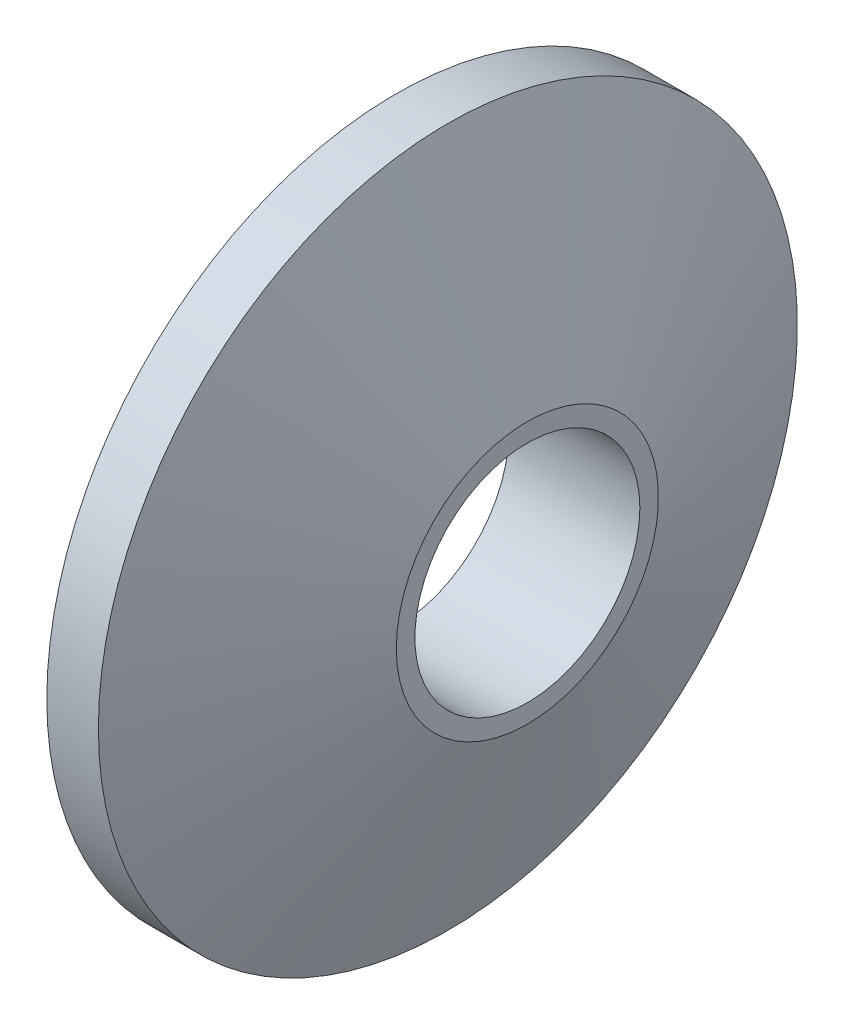
ISO-10303-21;
HEADER;
FILE_DESCRIPTION(('STEP AP214'),'2;1');
FILE_NAME('part.step','',(''),(''),'','','');
FILE_SCHEMA(('AUTOMOTIVE_DESIGN { 1 0 10303 214 1 1 1 1 }'));
ENDSEC;
DATA;
#1=APPLICATION_CONTEXT('core data for automotive mechanical design processes');
#2=APPLICATION_PROTOCOL_DEFINITION('international standard','automotive_design',2000,#1);
#3=PRODUCT_CONTEXT('',#1,'mechanical');
#4=PRODUCT('Part','Part','',(#3));
#5=PRODUCT_RELATED_PRODUCT_CATEGORY('part','',(#4));
#6=PRODUCT_DEFINITION_FORMATION('','',#4);
#7=PRODUCT_DEFINITION_CONTEXT('part definition',#1,'design');
#8=PRODUCT_DEFINITION('design','',#6,#7);
#9=PRODUCT_DEFINITION_SHAPE('','',#8);
#10=(LENGTH_UNIT() NAMED_UNIT(*) SI_UNIT(.MILLI.,.METRE.));
#11=(NAMED_UNIT(*) PLANE_ANGLE_UNIT() SI_UNIT($,.RADIAN.));
#12=(NAMED_UNIT(*) SI_UNIT($,.STERADIAN.) SOLID_ANGLE_UNIT());
#13=UNCERTAINTY_MEASURE_WITH_UNIT(LENGTH_MEASURE(1.E-05),#10,'distance_accuracy_value','');
#14=(GEOMETRIC_REPRESENTATION_CONTEXT(3) GLOBAL_UNCERTAINTY_ASSIGNED_CONTEXT((#13)) GLOBAL_UNIT_ASSIGNED_CONTEXT((#10,
#11,#12)) REPRESENTATION_CONTEXT('',''));
#15=CARTESIAN_POINT('',(0.,0.,0.));
#16=DIRECTION('',(0.,0.,1.));
#17=DIRECTION('',(1.,0.,0.));
#18=AXIS2_PLACEMENT_3D('',#15,#16,#17);
#19=CARTESIAN_POINT('',(0.,0.,0.));
#20=DIRECTION('',(1.,0.,0.));
#21=DIRECTION('',(0.,0.,-1.));
#22=AXIS2_PLACEMENT_3D('',#19,#20,#21);
#23=PLANE('',#22);
#24=CARTESIAN_POINT('',(0.,0.,0.));
#25=DIRECTION('',(1.,0.,0.));
#26=DIRECTION('',(0.,0.,-1.));
#27=AXIS2_PLACEMENT_3D('',#24,#25,#26);
#28=CIRCLE('',#27,2.575);
#29=CARTESIAN_POINT('',(0.,0.,-2.575));
#30=VERTEX_POINT('',#29);
#31=EDGE_CURVE('E54',#30,#30,#28,.T.);
#32=ORIENTED_EDGE('',*,*,#31,.T.);
#33=EDGE_LOOP('',(#32));
#34=FACE_BOUND('',#33,.T.);
#35=CARTESIAN_POINT('',(0.,0.,0.));
#36=DIRECTION('',(-1.,0.,0.));
#37=DIRECTION('',(0.,0.,1.));
#38=AXIS2_PLACEMENT_3D('',#35,#36,#37);
#39=CIRCLE('',#38,8.);
#40=CARTESIAN_POINT('',(0.,0.,8.));
#41=VERTEX_POINT('',#40);
#42=EDGE_CURVE('E10',#41,#41,#39,.T.);
#43=ORIENTED_EDGE('',*,*,#42,.T.);
#44=EDGE_LOOP('',(#43));
#45=FACE_BOUND('',#44,.T.);
#46=ADVANCED_FACE('F37',(#34,#45),#23,.F.);
#47=CARTESIAN_POINT('',(-13.2765957446808,0.,0.));
#48=DIRECTION('',(-1.,0.,0.));
#49=DIRECTION('',(0.,0.,1.));
#50=AXIS2_PLACEMENT_3D('',#47,#48,#49);
#51=CYLINDRICAL_SURFACE('',#50,8.);
#52=ORIENTED_EDGE('',*,*,#42,.F.);
#53=EDGE_LOOP('',(#52));
#54=FACE_BOUND('',#53,.T.);
#55=CARTESIAN_POINT('',(1.18014882866898,0.,0.));
#56=DIRECTION('',(-1.,0.,0.));
#57=DIRECTION('',(0.,0.,1.));
#58=AXIS2_PLACEMENT_3D('',#55,#56,#57);
#59=CIRCLE('',#58,8.);
#60=CARTESIAN_POINT('',(1.18014882866898,0.,8.));
#61=VERTEX_POINT('',#60);
#62=EDGE_CURVE('E44',#61,#61,#59,.T.);
#63=ORIENTED_EDGE('',*,*,#62,.T.);
#64=EDGE_LOOP('',(#63));
#65=FACE_BOUND('',#64,.T.);
#66=ADVANCED_FACE('F80',(#54,#65),#51,.T.);
#67=CARTESIAN_POINT('',(3.,0.,0.));
#68=DIRECTION('',(-1.,0.,0.));
#69=DIRECTION('',(0.,0.,1.));
#70=AXIS2_PLACEMENT_3D('',#67,#68,#69);
#71=CONICAL_SURFACE('',#70,3.,1.22173047639603);
#72=ORIENTED_EDGE('',*,*,#62,.F.);
#73=EDGE_LOOP('',(#72));
#74=FACE_BOUND('',#73,.T.);
#75=CARTESIAN_POINT('',(3.,0.,0.));
#76=DIRECTION('',(-1.,0.,0.));
#77=DIRECTION('',(0.,0.,1.));
#78=AXIS2_PLACEMENT_3D('',#75,#76,#77);
#79=CIRCLE('',#78,3.);
#80=CARTESIAN_POINT('',(3.,0.,3.));
#81=VERTEX_POINT('',#80);
#82=EDGE_CURVE('E49',#81,#81,#79,.T.);
#83=ORIENTED_EDGE('',*,*,#82,.T.);
#84=EDGE_LOOP('',(#83));
#85=FACE_BOUND('',#84,.T.);
#86=ADVANCED_FACE('F75',(#74,#85),#71,.T.);
#87=CARTESIAN_POINT('',(3.,3.,0.));
#88=DIRECTION('',(-1.,0.,0.));
#89=DIRECTION('',(0.,0.,1.));
#90=AXIS2_PLACEMENT_3D('',#87,#88,#89);
#91=PLANE('',#90);
#92=CARTESIAN_POINT('',(3.,0.,0.));
#93=DIRECTION('',(1.,0.,0.));
#94=DIRECTION('',(0.,0.,-1.));
#95=AXIS2_PLACEMENT_3D('',#92,#93,#94);
#96=CIRCLE('',#95,2.575);
#97=CARTESIAN_POINT('',(3.,0.,-2.575));
#98=VERTEX_POINT('',#97);
#99=EDGE_CURVE('E57',#98,#98,#96,.T.);
#100=ORIENTED_EDGE('',*,*,#99,.F.);
#101=EDGE_LOOP('',(#100));
#102=FACE_BOUND('',#101,.T.);
#103=ORIENTED_EDGE('',*,*,#82,.F.);
#104=EDGE_LOOP('',(#103));
#105=FACE_BOUND('',#104,.T.);
#106=ADVANCED_FACE('F69',(#102,#105),#91,.F.);
#107=CARTESIAN_POINT('',(0.,0.,0.));
#108=DIRECTION('',(1.,0.,0.));
#109=DIRECTION('',(0.,0.,-1.));
#110=AXIS2_PLACEMENT_3D('',#107,#108,#109);
#111=CYLINDRICAL_SURFACE('',#110,2.575);
#112=ORIENTED_EDGE('',*,*,#31,.F.);
#113=EDGE_LOOP('',(#112));
#114=FACE_BOUND('',#113,.T.);
#115=ORIENTED_EDGE('',*,*,#99,.T.);
#116=EDGE_LOOP('',(#115));
#117=FACE_BOUND('',#116,.T.);
#118=ADVANCED_FACE('F66',(#114,#117),#111,.F.);
#119=CLOSED_SHELL('',(#46,#66,#86,#106,#118));
#120=MANIFOLD_SOLID_BREP('B2',#119);
#121=ADVANCED_BREP_SHAPE_REPRESENTATION('',(#18,#120),#14);
#122=SHAPE_DEFINITION_REPRESENTATION(#9,#121);
ENDSEC;
END-ISO-10303-21;
